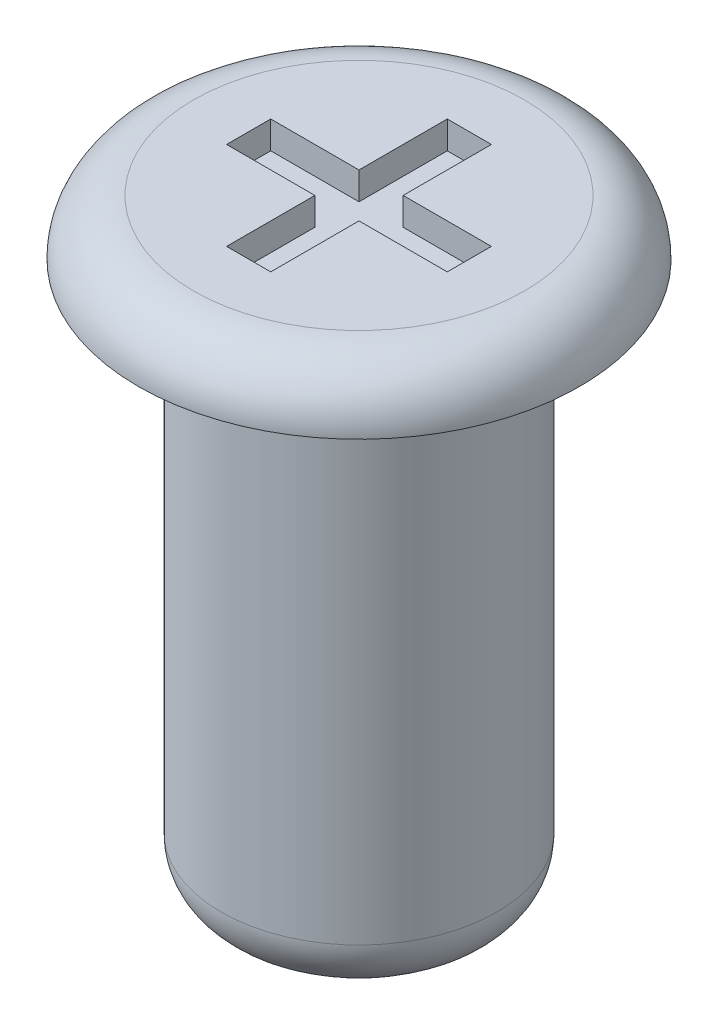
ISO-10303-21;
HEADER;
FILE_DESCRIPTION(('STEP AP214'),'2;1');
FILE_NAME('part.step','',(''),(''),'','','');
FILE_SCHEMA(('AUTOMOTIVE_DESIGN { 1 0 10303 214 1 1 1 1 }'));
ENDSEC;
DATA;
#1=APPLICATION_CONTEXT('core data for automotive mechanical design processes');
#2=APPLICATION_PROTOCOL_DEFINITION('international standard','automotive_design',2000,#1);
#3=PRODUCT_CONTEXT('',#1,'mechanical');
#4=PRODUCT('Part','Part','',(#3));
#5=PRODUCT_RELATED_PRODUCT_CATEGORY('part','',(#4));
#6=PRODUCT_DEFINITION_FORMATION('','',#4);
#7=PRODUCT_DEFINITION_CONTEXT('part definition',#1,'design');
#8=PRODUCT_DEFINITION('design','',#6,#7);
#9=PRODUCT_DEFINITION_SHAPE('','',#8);
#10=(LENGTH_UNIT() NAMED_UNIT(*) SI_UNIT(.MILLI.,.METRE.));
#11=(NAMED_UNIT(*) PLANE_ANGLE_UNIT() SI_UNIT($,.RADIAN.));
#12=(NAMED_UNIT(*) SI_UNIT($,.STERADIAN.) SOLID_ANGLE_UNIT());
#13=UNCERTAINTY_MEASURE_WITH_UNIT(LENGTH_MEASURE(1.E-05),#10,'distance_accuracy_value','');
#14=(GEOMETRIC_REPRESENTATION_CONTEXT(3) GLOBAL_UNCERTAINTY_ASSIGNED_CONTEXT((#13)) GLOBAL_UNIT_ASSIGNED_CONTEXT((#10,
#11,#12)) REPRESENTATION_CONTEXT('',''));
#15=CARTESIAN_POINT('',(0.,0.,0.));
#16=DIRECTION('',(0.,0.,1.));
#17=DIRECTION('',(1.,0.,0.));
#18=AXIS2_PLACEMENT_3D('',#15,#16,#17);
#19=CARTESIAN_POINT('',(0.,25.4,0.));
#20=DIRECTION('',(0.,-1.,0.));
#21=DIRECTION('',(0.,0.,-1.));
#22=AXIS2_PLACEMENT_3D('',#19,#20,#21);
#23=CYLINDRICAL_SURFACE('',#22,6.35);
#24=CARTESIAN_POINT('',(0.,2.54,0.));
#25=DIRECTION('',(0.,1.,0.));
#26=DIRECTION('',(0.,0.,1.));
#27=AXIS2_PLACEMENT_3D('',#24,#25,#26);
#28=CIRCLE('',#27,6.35);
#29=CARTESIAN_POINT('',(0.,2.54,6.35));
#30=VERTEX_POINT('',#29);
#31=EDGE_CURVE('E43',#30,#30,#28,.T.);
#32=ORIENTED_EDGE('',*,*,#31,.T.);
#33=EDGE_LOOP('',(#32));
#34=FACE_BOUND('',#33,.T.);
#35=CARTESIAN_POINT('',(0.,25.4,0.));
#36=DIRECTION('',(0.,1.,0.));
#37=DIRECTION('',(0.,0.,1.));
#38=AXIS2_PLACEMENT_3D('',#35,#36,#37);
#39=CIRCLE('',#38,6.35);
#40=CARTESIAN_POINT('',(0.,25.4,6.35));
#41=VERTEX_POINT('',#40);
#42=EDGE_CURVE('E212',#41,#41,#39,.T.);
#43=ORIENTED_EDGE('',*,*,#42,.F.);
#44=EDGE_LOOP('',(#43));
#45=FACE_BOUND('',#44,.T.);
#46=ADVANCED_FACE('F35',(#34,#45),#23,.T.);
#47=CARTESIAN_POINT('',(0.,0.,0.));
#48=DIRECTION('',(0.,1.,0.));
#49=DIRECTION('',(0.,0.,1.));
#50=AXIS2_PLACEMENT_3D('',#47,#48,#49);
#51=PLANE('',#50);
#52=CARTESIAN_POINT('',(0.,0.,0.));
#53=DIRECTION('',(0.,1.,0.));
#54=DIRECTION('',(0.,0.,1.));
#55=AXIS2_PLACEMENT_3D('',#52,#53,#54);
#56=CIRCLE('',#55,3.81);
#57=CARTESIAN_POINT('',(0.,0.,3.81));
#58=VERTEX_POINT('',#57);
#59=EDGE_CURVE('E11',#58,#58,#56,.F.);
#60=ORIENTED_EDGE('',*,*,#59,.T.);
#61=EDGE_LOOP('',(#60));
#62=FACE_BOUND('',#61,.T.);
#63=ADVANCED_FACE('F231',(#62),#51,.F.);
#64=CARTESIAN_POINT('',(0.,27.94,0.));
#65=DIRECTION('',(0.,1.,0.));
#66=DIRECTION('',(0.,0.,1.));
#67=AXIS2_PLACEMENT_3D('',#64,#65,#66);
#68=PLANE('',#67);
#69=DIRECTION('',(0.,0.,1.));
#70=VECTOR('',#69,1.);
#71=CARTESIAN_POINT('',(-5.08,27.94,0.));
#72=LINE('',#71,#70);
#73=CARTESIAN_POINT('',(-5.08,27.94,-1.016));
#74=VERTEX_POINT('',#73);
#75=CARTESIAN_POINT('',(-5.08,27.94,1.016));
#76=VERTEX_POINT('',#75);
#77=EDGE_CURVE('E50',#74,#76,#72,.T.);
#78=ORIENTED_EDGE('',*,*,#77,.F.);
#79=DIRECTION('',(1.,0.,0.));
#80=VECTOR('',#79,1.);
#81=CARTESIAN_POINT('',(0.,27.94,-1.016));
#82=LINE('',#81,#80);
#83=CARTESIAN_POINT('',(-1.016,27.94,-1.016));
#84=VERTEX_POINT('',#83);
#85=EDGE_CURVE('E187',#74,#84,#82,.T.);
#86=ORIENTED_EDGE('',*,*,#85,.T.);
#87=DIRECTION('',(0.,0.,-1.));
#88=VECTOR('',#87,1.);
#89=CARTESIAN_POINT('',(-1.016,27.94,0.));
#90=LINE('',#89,#88);
#91=CARTESIAN_POINT('',(-1.016,27.94,-5.08));
#92=VERTEX_POINT('',#91);
#93=EDGE_CURVE('E185',#84,#92,#90,.T.);
#94=ORIENTED_EDGE('',*,*,#93,.T.);
#95=DIRECTION('',(1.,0.,0.));
#96=VECTOR('',#95,1.);
#97=CARTESIAN_POINT('',(0.,27.94,-5.08));
#98=LINE('',#97,#96);
#99=CARTESIAN_POINT('',(1.016,27.94,-5.08));
#100=VERTEX_POINT('',#99);
#101=EDGE_CURVE('E143',#92,#100,#98,.T.);
#102=ORIENTED_EDGE('',*,*,#101,.T.);
#103=DIRECTION('',(0.,0.,-1.));
#104=VECTOR('',#103,1.);
#105=CARTESIAN_POINT('',(1.016,27.94,0.));
#106=LINE('',#105,#104);
#107=CARTESIAN_POINT('',(1.016,27.94,-1.016));
#108=VERTEX_POINT('',#107);
#109=EDGE_CURVE('E181',#108,#100,#106,.T.);
#110=ORIENTED_EDGE('',*,*,#109,.F.);
#111=DIRECTION('',(1.,0.,0.));
#112=VECTOR('',#111,1.);
#113=CARTESIAN_POINT('',(0.,27.94,-1.016));
#114=LINE('',#113,#112);
#115=CARTESIAN_POINT('',(5.08,27.94,-1.016));
#116=VERTEX_POINT('',#115);
#117=EDGE_CURVE('E178',#108,#116,#114,.T.);
#118=ORIENTED_EDGE('',*,*,#117,.T.);
#119=DIRECTION('',(0.,0.,1.));
#120=VECTOR('',#119,1.);
#121=CARTESIAN_POINT('',(5.08,27.94,0.));
#122=LINE('',#121,#120);
#123=CARTESIAN_POINT('',(5.08,27.94,1.016));
#124=VERTEX_POINT('',#123);
#125=EDGE_CURVE('E175',#116,#124,#122,.T.);
#126=ORIENTED_EDGE('',*,*,#125,.T.);
#127=DIRECTION('',(1.,0.,0.));
#128=VECTOR('',#127,1.);
#129=CARTESIAN_POINT('',(0.,27.94,1.016));
#130=LINE('',#129,#128);
#131=CARTESIAN_POINT('',(1.016,27.94,1.016));
#132=VERTEX_POINT('',#131);
#133=EDGE_CURVE('E172',#132,#124,#130,.T.);
#134=ORIENTED_EDGE('',*,*,#133,.F.);
#135=DIRECTION('',(0.,0.,-1.));
#136=VECTOR('',#135,1.);
#137=CARTESIAN_POINT('',(1.016,27.94,0.));
#138=LINE('',#137,#136);
#139=CARTESIAN_POINT('',(1.016,27.94,5.08));
#140=VERTEX_POINT('',#139);
#141=EDGE_CURVE('E169',#140,#132,#138,.T.);
#142=ORIENTED_EDGE('',*,*,#141,.F.);
#143=DIRECTION('',(1.,0.,0.));
#144=VECTOR('',#143,1.);
#145=CARTESIAN_POINT('',(0.,27.94,5.08));
#146=LINE('',#145,#144);
#147=CARTESIAN_POINT('',(-1.016,27.94,5.08));
#148=VERTEX_POINT('',#147);
#149=EDGE_CURVE('E166',#148,#140,#146,.T.);
#150=ORIENTED_EDGE('',*,*,#149,.F.);
#151=DIRECTION('',(0.,0.,-1.));
#152=VECTOR('',#151,1.);
#153=CARTESIAN_POINT('',(-1.016,27.94,0.));
#154=LINE('',#153,#152);
#155=CARTESIAN_POINT('',(-1.016,27.94,1.016));
#156=VERTEX_POINT('',#155);
#157=EDGE_CURVE('E163',#148,#156,#154,.T.);
#158=ORIENTED_EDGE('',*,*,#157,.T.);
#159=DIRECTION('',(1.,0.,0.));
#160=VECTOR('',#159,1.);
#161=CARTESIAN_POINT('',(0.,27.94,1.016));
#162=LINE('',#161,#160);
#163=EDGE_CURVE('E160',#76,#156,#162,.T.);
#164=ORIENTED_EDGE('',*,*,#163,.F.);
#165=EDGE_LOOP('',(#78,#86,#94,#102,#110,#118,#126,#134,#142,#150,#158,#164));
#166=FACE_BOUND('',#165,.T.);
#167=CARTESIAN_POINT('',(0.,27.94,0.));
#168=DIRECTION('',(0.,1.,0.));
#169=DIRECTION('',(0.,0.,1.));
#170=AXIS2_PLACEMENT_3D('',#167,#168,#169);
#171=CIRCLE('',#170,7.62);
#172=CARTESIAN_POINT('',(0.,27.94,7.62));
#173=VERTEX_POINT('',#172);
#174=EDGE_CURVE('E215',#173,#173,#171,.T.);
#175=ORIENTED_EDGE('',*,*,#174,.T.);
#176=EDGE_LOOP('',(#175));
#177=FACE_BOUND('',#176,.T.);
#178=ADVANCED_FACE('F236',(#166,#177),#68,.T.);
#179=CARTESIAN_POINT('',(0.,25.4,0.));
#180=DIRECTION('',(0.,1.,0.));
#181=DIRECTION('',(0.,0.,1.));
#182=AXIS2_PLACEMENT_3D('',#179,#180,#181);
#183=PLANE('',#182);
#184=ORIENTED_EDGE('',*,*,#42,.T.);
#185=EDGE_LOOP('',(#184));
#186=FACE_BOUND('',#185,.T.);
#187=CARTESIAN_POINT('',(0.,25.4,0.));
#188=DIRECTION('',(0.,1.,0.));
#189=DIRECTION('',(0.,0.,1.));
#190=AXIS2_PLACEMENT_3D('',#187,#188,#189);
#191=CIRCLE('',#190,10.16);
#192=CARTESIAN_POINT('',(0.,25.4,10.16));
#193=VERTEX_POINT('',#192);
#194=EDGE_CURVE('E192',#193,#193,#191,.T.);
#195=ORIENTED_EDGE('',*,*,#194,.F.);
#196=EDGE_LOOP('',(#195));
#197=FACE_BOUND('',#196,.T.);
#198=ADVANCED_FACE('F243',(#186,#197),#183,.F.);
#199=CARTESIAN_POINT('',(0.,25.4,0.));
#200=DIRECTION('',(0.,1.,0.));
#201=DIRECTION('',(0.,0.,1.));
#202=AXIS2_PLACEMENT_3D('',#199,#200,#201);
#203=TOROIDAL_SURFACE('',#202,7.62,2.54);
#204=ORIENTED_EDGE('',*,*,#194,.T.);
#205=EDGE_LOOP('',(#204));
#206=FACE_BOUND('',#205,.T.);
#207=ORIENTED_EDGE('',*,*,#174,.F.);
#208=EDGE_LOOP('',(#207));
#209=FACE_BOUND('',#208,.T.);
#210=ADVANCED_FACE('F240',(#206,#209),#203,.T.);
#211=CARTESIAN_POINT('',(-5.08,26.67,0.));
#212=DIRECTION('',(-1.,0.,0.));
#213=DIRECTION('',(0.,0.,1.));
#214=AXIS2_PLACEMENT_3D('',#211,#212,#213);
#215=PLANE('',#214);
#216=ORIENTED_EDGE('',*,*,#77,.T.);
#217=DIRECTION('',(0.,1.,0.));
#218=VECTOR('',#217,1.);
#219=CARTESIAN_POINT('',(-5.08,26.67,1.016));
#220=LINE('',#219,#218);
#221=CARTESIAN_POINT('',(-5.08,26.67,1.016));
#222=VERTEX_POINT('',#221);
#223=EDGE_CURVE('E98',#222,#76,#220,.T.);
#224=ORIENTED_EDGE('',*,*,#223,.F.);
#225=DIRECTION('',(0.,0.,1.));
#226=VECTOR('',#225,1.);
#227=CARTESIAN_POINT('',(-5.08,26.67,0.));
#228=LINE('',#227,#226);
#229=CARTESIAN_POINT('',(-5.08,26.67,-1.016));
#230=VERTEX_POINT('',#229);
#231=EDGE_CURVE('E190',#230,#222,#228,.T.);
#232=ORIENTED_EDGE('',*,*,#231,.F.);
#233=DIRECTION('',(0.,1.,0.));
#234=VECTOR('',#233,1.);
#235=CARTESIAN_POINT('',(-5.08,26.67,-1.016));
#236=LINE('',#235,#234);
#237=EDGE_CURVE('E58',#230,#74,#236,.T.);
#238=ORIENTED_EDGE('',*,*,#237,.T.);
#239=EDGE_LOOP('',(#216,#224,#232,#238));
#240=FACE_BOUND('',#239,.T.);
#241=ADVANCED_FACE('F242',(#240),#215,.F.);
#242=CARTESIAN_POINT('',(0.,26.67,-1.016));
#243=DIRECTION('',(0.,0.,1.));
#244=DIRECTION('',(1.,0.,0.));
#245=AXIS2_PLACEMENT_3D('',#242,#243,#244);
#246=PLANE('',#245);
#247=ORIENTED_EDGE('',*,*,#85,.F.);
#248=ORIENTED_EDGE('',*,*,#237,.F.);
#249=DIRECTION('',(1.,0.,0.));
#250=VECTOR('',#249,1.);
#251=CARTESIAN_POINT('',(0.,26.67,-1.016));
#252=LINE('',#251,#250);
#253=CARTESIAN_POINT('',(-1.016,26.67,-1.016));
#254=VERTEX_POINT('',#253);
#255=EDGE_CURVE('E136',#230,#254,#252,.T.);
#256=ORIENTED_EDGE('',*,*,#255,.T.);
#257=DIRECTION('',(0.,1.,0.));
#258=VECTOR('',#257,1.);
#259=CARTESIAN_POINT('',(-1.016,26.67,-1.016));
#260=LINE('',#259,#258);
#261=EDGE_CURVE('E133',#254,#84,#260,.T.);
#262=ORIENTED_EDGE('',*,*,#261,.T.);
#263=EDGE_LOOP('',(#247,#248,#256,#262));
#264=FACE_BOUND('',#263,.T.);
#265=ADVANCED_FACE('F249',(#264),#246,.T.);
#266=CARTESIAN_POINT('',(-1.016,26.67,0.));
#267=DIRECTION('',(1.,0.,0.));
#268=DIRECTION('',(0.,0.,-1.));
#269=AXIS2_PLACEMENT_3D('',#266,#267,#268);
#270=PLANE('',#269);
#271=ORIENTED_EDGE('',*,*,#93,.F.);
#272=ORIENTED_EDGE('',*,*,#261,.F.);
#273=DIRECTION('',(0.,0.,-1.));
#274=VECTOR('',#273,1.);
#275=CARTESIAN_POINT('',(-1.016,26.67,0.));
#276=LINE('',#275,#274);
#277=CARTESIAN_POINT('',(-1.016,26.67,-5.08));
#278=VERTEX_POINT('',#277);
#279=EDGE_CURVE('E127',#254,#278,#276,.T.);
#280=ORIENTED_EDGE('',*,*,#279,.T.);
#281=DIRECTION('',(0.,1.,0.));
#282=VECTOR('',#281,1.);
#283=CARTESIAN_POINT('',(-1.016,26.67,-5.08));
#284=LINE('',#283,#282);
#285=EDGE_CURVE('E131',#278,#92,#284,.T.);
#286=ORIENTED_EDGE('',*,*,#285,.T.);
#287=EDGE_LOOP('',(#271,#272,#280,#286));
#288=FACE_BOUND('',#287,.T.);
#289=ADVANCED_FACE('F130',(#288),#270,.T.);
#290=CARTESIAN_POINT('',(0.,26.67,-5.08));
#291=DIRECTION('',(0.,0.,1.));
#292=DIRECTION('',(1.,0.,0.));
#293=AXIS2_PLACEMENT_3D('',#290,#291,#292);
#294=PLANE('',#293);
#295=ORIENTED_EDGE('',*,*,#101,.F.);
#296=ORIENTED_EDGE('',*,*,#285,.F.);
#297=DIRECTION('',(1.,0.,0.));
#298=VECTOR('',#297,1.);
#299=CARTESIAN_POINT('',(0.,26.67,-5.08));
#300=LINE('',#299,#298);
#301=CARTESIAN_POINT('',(1.016,26.67,-5.08));
#302=VERTEX_POINT('',#301);
#303=EDGE_CURVE('E137',#278,#302,#300,.T.);
#304=ORIENTED_EDGE('',*,*,#303,.T.);
#305=DIRECTION('',(0.,1.,0.));
#306=VECTOR('',#305,1.);
#307=CARTESIAN_POINT('',(1.016,26.67,-5.08));
#308=LINE('',#307,#306);
#309=EDGE_CURVE('E145',#302,#100,#308,.T.);
#310=ORIENTED_EDGE('',*,*,#309,.T.);
#311=EDGE_LOOP('',(#295,#296,#304,#310));
#312=FACE_BOUND('',#311,.T.);
#313=ADVANCED_FACE('F140',(#312),#294,.T.);
#314=CARTESIAN_POINT('',(1.016,26.67,0.));
#315=DIRECTION('',(1.,0.,0.));
#316=DIRECTION('',(0.,0.,-1.));
#317=AXIS2_PLACEMENT_3D('',#314,#315,#316);
#318=PLANE('',#317);
#319=ORIENTED_EDGE('',*,*,#109,.T.);
#320=ORIENTED_EDGE('',*,*,#309,.F.);
#321=DIRECTION('',(0.,0.,-1.));
#322=VECTOR('',#321,1.);
#323=CARTESIAN_POINT('',(1.016,26.67,0.));
#324=LINE('',#323,#322);
#325=CARTESIAN_POINT('',(1.016,26.67,-1.016));
#326=VERTEX_POINT('',#325);
#327=EDGE_CURVE('E152',#326,#302,#324,.T.);
#328=ORIENTED_EDGE('',*,*,#327,.F.);
#329=DIRECTION('',(0.,1.,0.));
#330=VECTOR('',#329,1.);
#331=CARTESIAN_POINT('',(1.016,26.67,-1.016));
#332=LINE('',#331,#330);
#333=EDGE_CURVE('E195',#326,#108,#332,.T.);
#334=ORIENTED_EDGE('',*,*,#333,.T.);
#335=EDGE_LOOP('',(#319,#320,#328,#334));
#336=FACE_BOUND('',#335,.T.);
#337=ADVANCED_FACE('F288',(#336),#318,.F.);
#338=CARTESIAN_POINT('',(0.,26.67,-1.016));
#339=DIRECTION('',(0.,0.,1.));
#340=DIRECTION('',(1.,0.,0.));
#341=AXIS2_PLACEMENT_3D('',#338,#339,#340);
#342=PLANE('',#341);
#343=ORIENTED_EDGE('',*,*,#117,.F.);
#344=ORIENTED_EDGE('',*,*,#333,.F.);
#345=DIRECTION('',(1.,0.,0.));
#346=VECTOR('',#345,1.);
#347=CARTESIAN_POINT('',(0.,26.67,-1.016));
#348=LINE('',#347,#346);
#349=CARTESIAN_POINT('',(5.08,26.67,-1.016));
#350=VERTEX_POINT('',#349);
#351=EDGE_CURVE('E154',#326,#350,#348,.T.);
#352=ORIENTED_EDGE('',*,*,#351,.T.);
#353=DIRECTION('',(0.,1.,0.));
#354=VECTOR('',#353,1.);
#355=CARTESIAN_POINT('',(5.08,26.67,-1.016));
#356=LINE('',#355,#354);
#357=EDGE_CURVE('E197',#350,#116,#356,.T.);
#358=ORIENTED_EDGE('',*,*,#357,.T.);
#359=EDGE_LOOP('',(#343,#344,#352,#358));
#360=FACE_BOUND('',#359,.T.);
#361=ADVANCED_FACE('F284',(#360),#342,.T.);
#362=CARTESIAN_POINT('',(5.08,26.67,0.));
#363=DIRECTION('',(-1.,0.,0.));
#364=DIRECTION('',(0.,0.,1.));
#365=AXIS2_PLACEMENT_3D('',#362,#363,#364);
#366=PLANE('',#365);
#367=ORIENTED_EDGE('',*,*,#125,.F.);
#368=ORIENTED_EDGE('',*,*,#357,.F.);
#369=DIRECTION('',(0.,0.,1.));
#370=VECTOR('',#369,1.);
#371=CARTESIAN_POINT('',(5.08,26.67,0.));
#372=LINE('',#371,#370);
#373=CARTESIAN_POINT('',(5.08,26.67,1.016));
#374=VERTEX_POINT('',#373);
#375=EDGE_CURVE('E321',#350,#374,#372,.T.);
#376=ORIENTED_EDGE('',*,*,#375,.T.);
#377=DIRECTION('',(0.,1.,0.));
#378=VECTOR('',#377,1.);
#379=CARTESIAN_POINT('',(5.08,26.67,1.016));
#380=LINE('',#379,#378);
#381=EDGE_CURVE('E199',#374,#124,#380,.T.);
#382=ORIENTED_EDGE('',*,*,#381,.T.);
#383=EDGE_LOOP('',(#367,#368,#376,#382));
#384=FACE_BOUND('',#383,.T.);
#385=ADVANCED_FACE('F280',(#384),#366,.T.);
#386=CARTESIAN_POINT('',(0.,26.67,1.016));
#387=DIRECTION('',(0.,0.,1.));
#388=DIRECTION('',(1.,0.,0.));
#389=AXIS2_PLACEMENT_3D('',#386,#387,#388);
#390=PLANE('',#389);
#391=ORIENTED_EDGE('',*,*,#133,.T.);
#392=ORIENTED_EDGE('',*,*,#381,.F.);
#393=DIRECTION('',(1.,0.,0.));
#394=VECTOR('',#393,1.);
#395=CARTESIAN_POINT('',(0.,26.67,1.016));
#396=LINE('',#395,#394);
#397=CARTESIAN_POINT('',(1.016,26.67,1.016));
#398=VERTEX_POINT('',#397);
#399=EDGE_CURVE('E318',#398,#374,#396,.T.);
#400=ORIENTED_EDGE('',*,*,#399,.F.);
#401=DIRECTION('',(0.,1.,0.));
#402=VECTOR('',#401,1.);
#403=CARTESIAN_POINT('',(1.016,26.67,1.016));
#404=LINE('',#403,#402);
#405=EDGE_CURVE('E201',#398,#132,#404,.T.);
#406=ORIENTED_EDGE('',*,*,#405,.T.);
#407=EDGE_LOOP('',(#391,#392,#400,#406));
#408=FACE_BOUND('',#407,.T.);
#409=ADVANCED_FACE('F276',(#408),#390,.F.);
#410=CARTESIAN_POINT('',(1.016,26.67,0.));
#411=DIRECTION('',(1.,0.,0.));
#412=DIRECTION('',(0.,0.,-1.));
#413=AXIS2_PLACEMENT_3D('',#410,#411,#412);
#414=PLANE('',#413);
#415=ORIENTED_EDGE('',*,*,#141,.T.);
#416=ORIENTED_EDGE('',*,*,#405,.F.);
#417=DIRECTION('',(0.,0.,-1.));
#418=VECTOR('',#417,1.);
#419=CARTESIAN_POINT('',(1.016,26.67,0.));
#420=LINE('',#419,#418);
#421=CARTESIAN_POINT('',(1.016,26.67,5.08));
#422=VERTEX_POINT('',#421);
#423=EDGE_CURVE('E315',#422,#398,#420,.T.);
#424=ORIENTED_EDGE('',*,*,#423,.F.);
#425=DIRECTION('',(0.,1.,0.));
#426=VECTOR('',#425,1.);
#427=CARTESIAN_POINT('',(1.016,26.67,5.08));
#428=LINE('',#427,#426);
#429=EDGE_CURVE('E203',#422,#140,#428,.T.);
#430=ORIENTED_EDGE('',*,*,#429,.T.);
#431=EDGE_LOOP('',(#415,#416,#424,#430));
#432=FACE_BOUND('',#431,.T.);
#433=ADVANCED_FACE('F272',(#432),#414,.F.);
#434=CARTESIAN_POINT('',(0.,26.67,5.08));
#435=DIRECTION('',(0.,0.,1.));
#436=DIRECTION('',(1.,0.,0.));
#437=AXIS2_PLACEMENT_3D('',#434,#435,#436);
#438=PLANE('',#437);
#439=ORIENTED_EDGE('',*,*,#149,.T.);
#440=ORIENTED_EDGE('',*,*,#429,.F.);
#441=DIRECTION('',(1.,0.,0.));
#442=VECTOR('',#441,1.);
#443=CARTESIAN_POINT('',(0.,26.67,5.08));
#444=LINE('',#443,#442);
#445=CARTESIAN_POINT('',(-1.016,26.67,5.08));
#446=VERTEX_POINT('',#445);
#447=EDGE_CURVE('E312',#446,#422,#444,.T.);
#448=ORIENTED_EDGE('',*,*,#447,.F.);
#449=DIRECTION('',(0.,1.,0.));
#450=VECTOR('',#449,1.);
#451=CARTESIAN_POINT('',(-1.016,26.67,5.08));
#452=LINE('',#451,#450);
#453=EDGE_CURVE('E205',#446,#148,#452,.T.);
#454=ORIENTED_EDGE('',*,*,#453,.T.);
#455=EDGE_LOOP('',(#439,#440,#448,#454));
#456=FACE_BOUND('',#455,.T.);
#457=ADVANCED_FACE('F268',(#456),#438,.F.);
#458=CARTESIAN_POINT('',(-1.016,26.67,0.));
#459=DIRECTION('',(1.,0.,0.));
#460=DIRECTION('',(0.,0.,-1.));
#461=AXIS2_PLACEMENT_3D('',#458,#459,#460);
#462=PLANE('',#461);
#463=ORIENTED_EDGE('',*,*,#157,.F.);
#464=ORIENTED_EDGE('',*,*,#453,.F.);
#465=DIRECTION('',(0.,0.,-1.));
#466=VECTOR('',#465,1.);
#467=CARTESIAN_POINT('',(-1.016,26.67,0.));
#468=LINE('',#467,#466);
#469=CARTESIAN_POINT('',(-1.016,26.67,1.016));
#470=VERTEX_POINT('',#469);
#471=EDGE_CURVE('E307',#446,#470,#468,.T.);
#472=ORIENTED_EDGE('',*,*,#471,.T.);
#473=DIRECTION('',(0.,1.,0.));
#474=VECTOR('',#473,1.);
#475=CARTESIAN_POINT('',(-1.016,26.67,1.016));
#476=LINE('',#475,#474);
#477=EDGE_CURVE('E207',#470,#156,#476,.T.);
#478=ORIENTED_EDGE('',*,*,#477,.T.);
#479=EDGE_LOOP('',(#463,#464,#472,#478));
#480=FACE_BOUND('',#479,.T.);
#481=ADVANCED_FACE('F264',(#480),#462,.T.);
#482=CARTESIAN_POINT('',(0.,26.67,1.016));
#483=DIRECTION('',(0.,0.,1.));
#484=DIRECTION('',(1.,0.,0.));
#485=AXIS2_PLACEMENT_3D('',#482,#483,#484);
#486=PLANE('',#485);
#487=ORIENTED_EDGE('',*,*,#163,.T.);
#488=ORIENTED_EDGE('',*,*,#477,.F.);
#489=DIRECTION('',(1.,0.,0.));
#490=VECTOR('',#489,1.);
#491=CARTESIAN_POINT('',(0.,26.67,1.016));
#492=LINE('',#491,#490);
#493=EDGE_CURVE('E305',#222,#470,#492,.T.);
#494=ORIENTED_EDGE('',*,*,#493,.F.);
#495=ORIENTED_EDGE('',*,*,#223,.T.);
#496=EDGE_LOOP('',(#487,#488,#494,#495));
#497=FACE_BOUND('',#496,.T.);
#498=ADVANCED_FACE('F227',(#497),#486,.F.);
#499=CARTESIAN_POINT('',(0.,26.67,0.));
#500=DIRECTION('',(0.,1.,0.));
#501=DIRECTION('',(0.,0.,1.));
#502=AXIS2_PLACEMENT_3D('',#499,#500,#501);
#503=PLANE('',#502);
#504=ORIENTED_EDGE('',*,*,#231,.T.);
#505=ORIENTED_EDGE('',*,*,#493,.T.);
#506=ORIENTED_EDGE('',*,*,#471,.F.);
#507=ORIENTED_EDGE('',*,*,#447,.T.);
#508=ORIENTED_EDGE('',*,*,#423,.T.);
#509=ORIENTED_EDGE('',*,*,#399,.T.);
#510=ORIENTED_EDGE('',*,*,#375,.F.);
#511=ORIENTED_EDGE('',*,*,#351,.F.);
#512=ORIENTED_EDGE('',*,*,#327,.T.);
#513=ORIENTED_EDGE('',*,*,#303,.F.);
#514=ORIENTED_EDGE('',*,*,#279,.F.);
#515=ORIENTED_EDGE('',*,*,#255,.F.);
#516=EDGE_LOOP('',(#504,#505,#506,#507,#508,#509,#510,#511,#512,#513,#514,#515));
#517=FACE_BOUND('',#516,.T.);
#518=ADVANCED_FACE('F149',(#517),#503,.T.);
#519=CARTESIAN_POINT('',(0.,2.54,0.));
#520=DIRECTION('',(0.,1.,0.));
#521=DIRECTION('',(0.,0.,1.));
#522=AXIS2_PLACEMENT_3D('',#519,#520,#521);
#523=TOROIDAL_SURFACE('',#522,3.81,2.54);
#524=ORIENTED_EDGE('',*,*,#59,.F.);
#525=EDGE_LOOP('',(#524));
#526=FACE_BOUND('',#525,.T.);
#527=ORIENTED_EDGE('',*,*,#31,.F.);
#528=EDGE_LOOP('',(#527));
#529=FACE_BOUND('',#528,.T.);
#530=ADVANCED_FACE('F37',(#526,#529),#523,.T.);
#531=CLOSED_SHELL('',(#46,#63,#178,#198,#210,#241,#265,#289,#313,#337,#361,#385,#409,#433,#457,
#481,#498,#518,#530));
#532=MANIFOLD_SOLID_BREP('B2',#531);
#533=ADVANCED_BREP_SHAPE_REPRESENTATION('',(#18,#532),#14);
#534=SHAPE_DEFINITION_REPRESENTATION(#9,#533);
ENDSEC;
END-ISO-10303-21;
